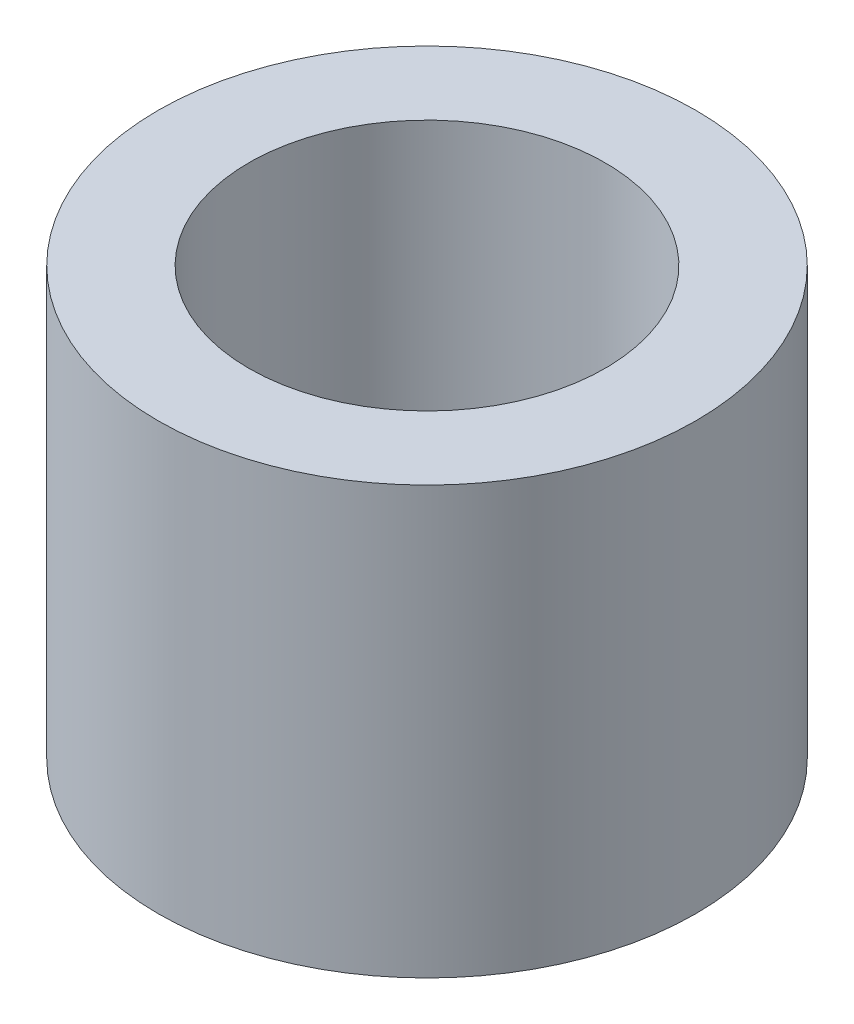
ISO-10303-21;
HEADER;
FILE_DESCRIPTION(('STEP AP214'),'2;1');
FILE_NAME('part.step','',(''),(''),'','','');
FILE_SCHEMA(('AUTOMOTIVE_DESIGN { 1 0 10303 214 1 1 1 1 }'));
ENDSEC;
DATA;
#1=APPLICATION_CONTEXT('core data for automotive mechanical design processes');
#2=APPLICATION_PROTOCOL_DEFINITION('international standard','automotive_design',2000,#1);
#3=PRODUCT_CONTEXT('',#1,'mechanical');
#4=PRODUCT('Part','Part','',(#3));
#5=PRODUCT_RELATED_PRODUCT_CATEGORY('part','',(#4));
#6=PRODUCT_DEFINITION_FORMATION('','',#4);
#7=PRODUCT_DEFINITION_CONTEXT('part definition',#1,'design');
#8=PRODUCT_DEFINITION('design','',#6,#7);
#9=PRODUCT_DEFINITION_SHAPE('','',#8);
#10=(LENGTH_UNIT() NAMED_UNIT(*) SI_UNIT(.MILLI.,.METRE.));
#11=(NAMED_UNIT(*) PLANE_ANGLE_UNIT() SI_UNIT($,.RADIAN.));
#12=(NAMED_UNIT(*) SI_UNIT($,.STERADIAN.) SOLID_ANGLE_UNIT());
#13=UNCERTAINTY_MEASURE_WITH_UNIT(LENGTH_MEASURE(1.E-05),#10,'distance_accuracy_value','');
#14=(GEOMETRIC_REPRESENTATION_CONTEXT(3) GLOBAL_UNCERTAINTY_ASSIGNED_CONTEXT((#13)) GLOBAL_UNIT_ASSIGNED_CONTEXT((#10,
#11,#12)) REPRESENTATION_CONTEXT('',''));
#15=CARTESIAN_POINT('',(0.,0.,0.));
#16=DIRECTION('',(0.,0.,1.));
#17=DIRECTION('',(1.,0.,0.));
#18=AXIS2_PLACEMENT_3D('',#15,#16,#17);
#19=CARTESIAN_POINT('',(0.,6.35,0.));
#20=DIRECTION('',(0.,1.,0.));
#21=DIRECTION('',(0.,0.,1.));
#22=AXIS2_PLACEMENT_3D('',#19,#20,#21);
#23=PLANE('',#22);
#24=CARTESIAN_POINT('',(0.,6.35,0.));
#25=DIRECTION('',(0.,1.,0.));
#26=DIRECTION('',(0.,0.,1.));
#27=AXIS2_PLACEMENT_3D('',#24,#25,#26);
#28=CIRCLE('',#27,4.);
#29=CARTESIAN_POINT('',(0.,6.35,4.));
#30=VERTEX_POINT('',#29);
#31=EDGE_CURVE('E10',#30,#30,#28,.T.);
#32=ORIENTED_EDGE('',*,*,#31,.T.);
#33=EDGE_LOOP('',(#32));
#34=FACE_BOUND('',#33,.T.);
#35=CARTESIAN_POINT('',(0.,6.35,0.));
#36=DIRECTION('',(0.,1.,0.));
#37=DIRECTION('',(0.,0.,1.));
#38=AXIS2_PLACEMENT_3D('',#35,#36,#37);
#39=CIRCLE('',#38,2.65);
#40=CARTESIAN_POINT('',(0.,6.35,2.65));
#41=VERTEX_POINT('',#40);
#42=EDGE_CURVE('E43',#41,#41,#39,.T.);
#43=ORIENTED_EDGE('',*,*,#42,.F.);
#44=EDGE_LOOP('',(#43));
#45=FACE_BOUND('',#44,.T.);
#46=ADVANCED_FACE('F32',(#34,#45),#23,.T.);
#47=CARTESIAN_POINT('',(0.,0.,0.));
#48=DIRECTION('',(0.,1.,0.));
#49=DIRECTION('',(0.,0.,1.));
#50=AXIS2_PLACEMENT_3D('',#47,#48,#49);
#51=PLANE('',#50);
#52=CARTESIAN_POINT('',(0.,0.,0.));
#53=DIRECTION('',(0.,1.,0.));
#54=DIRECTION('',(0.,0.,1.));
#55=AXIS2_PLACEMENT_3D('',#52,#53,#54);
#56=CIRCLE('',#55,4.);
#57=CARTESIAN_POINT('',(0.,0.,4.));
#58=VERTEX_POINT('',#57);
#59=EDGE_CURVE('E36',#58,#58,#56,.T.);
#60=ORIENTED_EDGE('',*,*,#59,.F.);
#61=EDGE_LOOP('',(#60));
#62=FACE_BOUND('',#61,.T.);
#63=CARTESIAN_POINT('',(0.,0.,0.));
#64=DIRECTION('',(0.,1.,0.));
#65=DIRECTION('',(0.,0.,1.));
#66=AXIS2_PLACEMENT_3D('',#63,#64,#65);
#67=CIRCLE('',#66,2.65);
#68=CARTESIAN_POINT('',(0.,0.,2.65));
#69=VERTEX_POINT('',#68);
#70=EDGE_CURVE('E45',#69,#69,#67,.T.);
#71=ORIENTED_EDGE('',*,*,#70,.T.);
#72=EDGE_LOOP('',(#71));
#73=FACE_BOUND('',#72,.T.);
#74=ADVANCED_FACE('F55',(#62,#73),#51,.F.);
#75=CARTESIAN_POINT('',(0.,6.35,0.));
#76=DIRECTION('',(0.,-1.,0.));
#77=DIRECTION('',(0.,0.,-1.));
#78=AXIS2_PLACEMENT_3D('',#75,#76,#77);
#79=CYLINDRICAL_SURFACE('',#78,4.);
#80=ORIENTED_EDGE('',*,*,#31,.F.);
#81=EDGE_LOOP('',(#80));
#82=FACE_BOUND('',#81,.T.);
#83=ORIENTED_EDGE('',*,*,#59,.T.);
#84=EDGE_LOOP('',(#83));
#85=FACE_BOUND('',#84,.T.);
#86=ADVANCED_FACE('F34',(#82,#85),#79,.T.);
#87=CARTESIAN_POINT('',(0.,6.35,0.));
#88=DIRECTION('',(0.,-1.,0.));
#89=DIRECTION('',(0.,0.,-1.));
#90=AXIS2_PLACEMENT_3D('',#87,#88,#89);
#91=CYLINDRICAL_SURFACE('',#90,2.65);
#92=ORIENTED_EDGE('',*,*,#42,.T.);
#93=EDGE_LOOP('',(#92));
#94=FACE_BOUND('',#93,.T.);
#95=ORIENTED_EDGE('',*,*,#70,.F.);
#96=EDGE_LOOP('',(#95));
#97=FACE_BOUND('',#96,.T.);
#98=ADVANCED_FACE('F51',(#94,#97),#91,.F.);
#99=CLOSED_SHELL('',(#46,#74,#86,#98));
#100=MANIFOLD_SOLID_BREP('B2',#99);
#101=ADVANCED_BREP_SHAPE_REPRESENTATION('',(#18,#100),#14);
#102=SHAPE_DEFINITION_REPRESENTATION(#9,#101);
ENDSEC;
END-ISO-10303-21;
